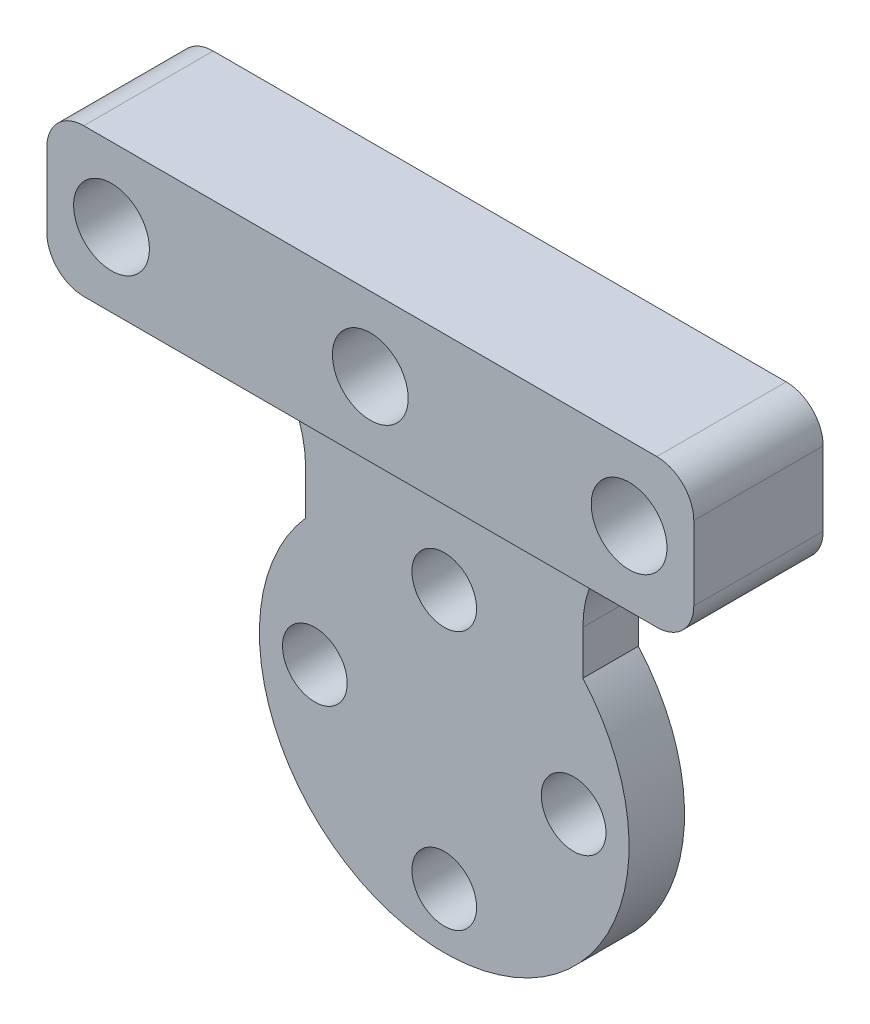
ISO-10303-21;
HEADER;
FILE_DESCRIPTION(('STEP AP214'),'2;1');
FILE_NAME('part.step','',(''),(''),'','','');
FILE_SCHEMA(('AUTOMOTIVE_DESIGN { 1 0 10303 214 1 1 1 1 }'));
ENDSEC;
DATA;
#1=APPLICATION_CONTEXT('core data for automotive mechanical design processes');
#2=APPLICATION_PROTOCOL_DEFINITION('international standard','automotive_design',2000,#1);
#3=PRODUCT_CONTEXT('',#1,'mechanical');
#4=PRODUCT('Part','Part','',(#3));
#5=PRODUCT_RELATED_PRODUCT_CATEGORY('part','',(#4));
#6=PRODUCT_DEFINITION_FORMATION('','',#4);
#7=PRODUCT_DEFINITION_CONTEXT('part definition',#1,'design');
#8=PRODUCT_DEFINITION('design','',#6,#7);
#9=PRODUCT_DEFINITION_SHAPE('','',#8);
#10=(LENGTH_UNIT() NAMED_UNIT(*) SI_UNIT(.MILLI.,.METRE.));
#11=(NAMED_UNIT(*) PLANE_ANGLE_UNIT() SI_UNIT($,.RADIAN.));
#12=(NAMED_UNIT(*) SI_UNIT($,.STERADIAN.) SOLID_ANGLE_UNIT());
#13=UNCERTAINTY_MEASURE_WITH_UNIT(LENGTH_MEASURE(1.E-05),#10,'distance_accuracy_value','');
#14=(GEOMETRIC_REPRESENTATION_CONTEXT(3) GLOBAL_UNCERTAINTY_ASSIGNED_CONTEXT((#13)) GLOBAL_UNIT_ASSIGNED_CONTEXT((#10,
#11,#12)) REPRESENTATION_CONTEXT('',''));
#15=CARTESIAN_POINT('',(0.,0.,0.));
#16=DIRECTION('',(0.,0.,1.));
#17=DIRECTION('',(1.,0.,0.));
#18=AXIS2_PLACEMENT_3D('',#15,#16,#17);
#19=CARTESIAN_POINT('',(0.,19.,0.));
#20=DIRECTION('',(0.,0.,1.));
#21=DIRECTION('',(1.,0.,0.));
#22=AXIS2_PLACEMENT_3D('',#19,#20,#21);
#23=CYLINDRICAL_SURFACE('',#22,1.75);
#24=CARTESIAN_POINT('',(0.,19.,0.));
#25=DIRECTION('',(0.,0.,1.));
#26=DIRECTION('',(1.,0.,0.));
#27=AXIS2_PLACEMENT_3D('',#24,#25,#26);
#28=CIRCLE('',#27,1.75);
#29=CARTESIAN_POINT('',(1.75,19.,0.));
#30=VERTEX_POINT('',#29);
#31=EDGE_CURVE('E274',#30,#30,#28,.T.);
#32=ORIENTED_EDGE('',*,*,#31,.F.);
#33=EDGE_LOOP('',(#32));
#34=FACE_BOUND('',#33,.T.);
#35=CARTESIAN_POINT('',(0.,19.,1.));
#36=DIRECTION('',(0.,0.,1.));
#37=DIRECTION('',(1.,0.,0.));
#38=AXIS2_PLACEMENT_3D('',#35,#36,#37);
#39=CIRCLE('',#38,1.75);
#40=CARTESIAN_POINT('',(1.75,19.,1.));
#41=VERTEX_POINT('',#40);
#42=EDGE_CURVE('E45',#41,#41,#39,.F.);
#43=ORIENTED_EDGE('',*,*,#42,.F.);
#44=EDGE_LOOP('',(#43));
#45=FACE_BOUND('',#44,.T.);
#46=ADVANCED_FACE('F41',(#34,#45),#23,.F.);
#47=CARTESIAN_POINT('',(-14.,19.,0.));
#48=DIRECTION('',(0.,0.,1.));
#49=DIRECTION('',(1.,0.,0.));
#50=AXIS2_PLACEMENT_3D('',#47,#48,#49);
#51=CYLINDRICAL_SURFACE('',#50,1.75);
#52=CARTESIAN_POINT('',(-14.,19.,0.));
#53=DIRECTION('',(0.,0.,1.));
#54=DIRECTION('',(1.,0.,0.));
#55=AXIS2_PLACEMENT_3D('',#52,#53,#54);
#56=CIRCLE('',#55,1.75);
#57=CARTESIAN_POINT('',(-12.25,19.,0.));
#58=VERTEX_POINT('',#57);
#59=EDGE_CURVE('E269',#58,#58,#56,.T.);
#60=ORIENTED_EDGE('',*,*,#59,.F.);
#61=EDGE_LOOP('',(#60));
#62=FACE_BOUND('',#61,.T.);
#63=CARTESIAN_POINT('',(-14.,19.,1.));
#64=DIRECTION('',(0.,0.,1.));
#65=DIRECTION('',(1.,0.,0.));
#66=AXIS2_PLACEMENT_3D('',#63,#64,#65);
#67=CIRCLE('',#66,1.75);
#68=CARTESIAN_POINT('',(-12.25,19.,1.));
#69=VERTEX_POINT('',#68);
#70=EDGE_CURVE('E259',#69,#69,#67,.F.);
#71=ORIENTED_EDGE('',*,*,#70,.F.);
#72=EDGE_LOOP('',(#71));
#73=FACE_BOUND('',#72,.T.);
#74=ADVANCED_FACE('F375',(#62,#73),#51,.F.);
#75=CARTESIAN_POINT('',(14.,19.,0.));
#76=DIRECTION('',(0.,0.,1.));
#77=DIRECTION('',(1.,0.,0.));
#78=AXIS2_PLACEMENT_3D('',#75,#76,#77);
#79=CYLINDRICAL_SURFACE('',#78,1.75);
#80=CARTESIAN_POINT('',(14.,19.,0.));
#81=DIRECTION('',(0.,0.,1.));
#82=DIRECTION('',(1.,0.,0.));
#83=AXIS2_PLACEMENT_3D('',#80,#81,#82);
#84=CIRCLE('',#83,1.75);
#85=CARTESIAN_POINT('',(15.75,19.,0.));
#86=VERTEX_POINT('',#85);
#87=EDGE_CURVE('E265',#86,#86,#84,.T.);
#88=ORIENTED_EDGE('',*,*,#87,.F.);
#89=EDGE_LOOP('',(#88));
#90=FACE_BOUND('',#89,.T.);
#91=CARTESIAN_POINT('',(14.,19.,1.));
#92=DIRECTION('',(0.,0.,1.));
#93=DIRECTION('',(1.,0.,0.));
#94=AXIS2_PLACEMENT_3D('',#91,#92,#93);
#95=CIRCLE('',#94,1.75);
#96=CARTESIAN_POINT('',(15.75,19.,1.));
#97=VERTEX_POINT('',#96);
#98=EDGE_CURVE('E257',#97,#97,#95,.F.);
#99=ORIENTED_EDGE('',*,*,#98,.F.);
#100=EDGE_LOOP('',(#99));
#101=FACE_BOUND('',#100,.T.);
#102=ADVANCED_FACE('F381',(#90,#101),#79,.F.);
#103=CARTESIAN_POINT('',(0.,0.,3.));
#104=DIRECTION('',(0.,0.,-1.));
#105=DIRECTION('',(-1.,0.,0.));
#106=AXIS2_PLACEMENT_3D('',#103,#104,#105);
#107=CYLINDRICAL_SURFACE('',#106,10.);
#108=DIRECTION('',(0.,0.,1.));
#109=VECTOR('',#108,1.);
#110=CARTESIAN_POINT('',(-7.5,6.61437827766148,-38.6456802143211));
#111=LINE('',#110,#109);
#112=CARTESIAN_POINT('',(-7.5,6.61437827766148,0.));
#113=VERTEX_POINT('',#112);
#114=CARTESIAN_POINT('',(-7.5,6.61437827766148,3.));
#115=VERTEX_POINT('',#114);
#116=EDGE_CURVE('E150',#113,#115,#111,.T.);
#117=ORIENTED_EDGE('',*,*,#116,.F.);
#118=CARTESIAN_POINT('',(0.,0.,0.));
#119=DIRECTION('',(0.,0.,1.));
#120=DIRECTION('',(1.,0.,0.));
#121=AXIS2_PLACEMENT_3D('',#118,#119,#120);
#122=CIRCLE('',#121,10.);
#123=CARTESIAN_POINT('',(7.5,6.61437827766148,0.));
#124=VERTEX_POINT('',#123);
#125=EDGE_CURVE('E160',#113,#124,#122,.T.);
#126=ORIENTED_EDGE('',*,*,#125,.T.);
#127=DIRECTION('',(0.,0.,1.));
#128=VECTOR('',#127,1.);
#129=CARTESIAN_POINT('',(7.5,6.61437827766148,-38.6456802143211));
#130=LINE('',#129,#128);
#131=CARTESIAN_POINT('',(7.5,6.61437827766148,3.));
#132=VERTEX_POINT('',#131);
#133=EDGE_CURVE('E173',#124,#132,#130,.T.);
#134=ORIENTED_EDGE('',*,*,#133,.T.);
#135=CARTESIAN_POINT('',(0.,0.,3.));
#136=DIRECTION('',(0.,0.,1.));
#137=DIRECTION('',(1.,0.,0.));
#138=AXIS2_PLACEMENT_3D('',#135,#136,#137);
#139=CIRCLE('',#138,10.);
#140=EDGE_CURVE('E171',#115,#132,#139,.T.);
#141=ORIENTED_EDGE('',*,*,#140,.F.);
#142=EDGE_LOOP('',(#117,#126,#134,#141));
#143=FACE_BOUND('',#142,.T.);
#144=ADVANCED_FACE('F169',(#143),#107,.T.);
#145=CARTESIAN_POINT('',(-7.,0.,3.));
#146=DIRECTION('',(0.,0.,-1.));
#147=DIRECTION('',(-1.,0.,0.));
#148=AXIS2_PLACEMENT_3D('',#145,#146,#147);
#149=CYLINDRICAL_SURFACE('',#148,1.75);
#150=CARTESIAN_POINT('',(-7.,0.,3.));
#151=DIRECTION('',(0.,0.,1.));
#152=DIRECTION('',(1.,0.,0.));
#153=AXIS2_PLACEMENT_3D('',#150,#151,#152);
#154=CIRCLE('',#153,1.75);
#155=CARTESIAN_POINT('',(-5.25,0.,3.));
#156=VERTEX_POINT('',#155);
#157=EDGE_CURVE('E192',#156,#156,#154,.T.);
#158=ORIENTED_EDGE('',*,*,#157,.T.);
#159=EDGE_LOOP('',(#158));
#160=FACE_BOUND('',#159,.T.);
#161=CARTESIAN_POINT('',(-7.,0.,0.));
#162=DIRECTION('',(0.,0.,1.));
#163=DIRECTION('',(1.,0.,0.));
#164=AXIS2_PLACEMENT_3D('',#161,#162,#163);
#165=CIRCLE('',#164,1.75);
#166=CARTESIAN_POINT('',(-5.25,0.,0.));
#167=VERTEX_POINT('',#166);
#168=EDGE_CURVE('E167',#167,#167,#165,.T.);
#169=ORIENTED_EDGE('',*,*,#168,.F.);
#170=EDGE_LOOP('',(#169));
#171=FACE_BOUND('',#170,.T.);
#172=ADVANCED_FACE('F359',(#160,#171),#149,.F.);
#173=CARTESIAN_POINT('',(0.,7.,3.));
#174=DIRECTION('',(0.,0.,-1.));
#175=DIRECTION('',(-1.,0.,0.));
#176=AXIS2_PLACEMENT_3D('',#173,#174,#175);
#177=CYLINDRICAL_SURFACE('',#176,1.75);
#178=CARTESIAN_POINT('',(0.,7.,3.));
#179=DIRECTION('',(0.,0.,1.));
#180=DIRECTION('',(1.,0.,0.));
#181=AXIS2_PLACEMENT_3D('',#178,#179,#180);
#182=CIRCLE('',#181,1.75);
#183=CARTESIAN_POINT('',(1.75,7.,3.));
#184=VERTEX_POINT('',#183);
#185=EDGE_CURVE('E189',#184,#184,#182,.T.);
#186=ORIENTED_EDGE('',*,*,#185,.T.);
#187=EDGE_LOOP('',(#186));
#188=FACE_BOUND('',#187,.T.);
#189=CARTESIAN_POINT('',(0.,7.,0.));
#190=DIRECTION('',(0.,0.,1.));
#191=DIRECTION('',(1.,0.,0.));
#192=AXIS2_PLACEMENT_3D('',#189,#190,#191);
#193=CIRCLE('',#192,1.75);
#194=CARTESIAN_POINT('',(1.75,7.,0.));
#195=VERTEX_POINT('',#194);
#196=EDGE_CURVE('E202',#195,#195,#193,.T.);
#197=ORIENTED_EDGE('',*,*,#196,.F.);
#198=EDGE_LOOP('',(#197));
#199=FACE_BOUND('',#198,.T.);
#200=ADVANCED_FACE('F362',(#188,#199),#177,.F.);
#201=CARTESIAN_POINT('',(7.,0.,3.));
#202=DIRECTION('',(0.,0.,-1.));
#203=DIRECTION('',(-1.,0.,0.));
#204=AXIS2_PLACEMENT_3D('',#201,#202,#203);
#205=CYLINDRICAL_SURFACE('',#204,1.75);
#206=CARTESIAN_POINT('',(7.,0.,3.));
#207=DIRECTION('',(0.,0.,1.));
#208=DIRECTION('',(1.,0.,0.));
#209=AXIS2_PLACEMENT_3D('',#206,#207,#208);
#210=CIRCLE('',#209,1.75);
#211=CARTESIAN_POINT('',(8.75,0.,3.));
#212=VERTEX_POINT('',#211);
#213=EDGE_CURVE('E186',#212,#212,#210,.T.);
#214=ORIENTED_EDGE('',*,*,#213,.T.);
#215=EDGE_LOOP('',(#214));
#216=FACE_BOUND('',#215,.T.);
#217=CARTESIAN_POINT('',(7.,0.,0.));
#218=DIRECTION('',(0.,0.,1.));
#219=DIRECTION('',(1.,0.,0.));
#220=AXIS2_PLACEMENT_3D('',#217,#218,#219);
#221=CIRCLE('',#220,1.75);
#222=CARTESIAN_POINT('',(8.75,0.,0.));
#223=VERTEX_POINT('',#222);
#224=EDGE_CURVE('E199',#223,#223,#221,.T.);
#225=ORIENTED_EDGE('',*,*,#224,.F.);
#226=EDGE_LOOP('',(#225));
#227=FACE_BOUND('',#226,.T.);
#228=ADVANCED_FACE('F646',(#216,#227),#205,.F.);
#229=CARTESIAN_POINT('',(0.,-7.,3.));
#230=DIRECTION('',(0.,0.,-1.));
#231=DIRECTION('',(-1.,0.,0.));
#232=AXIS2_PLACEMENT_3D('',#229,#230,#231);
#233=CYLINDRICAL_SURFACE('',#232,1.75);
#234=CARTESIAN_POINT('',(0.,-7.,3.));
#235=DIRECTION('',(0.,0.,1.));
#236=DIRECTION('',(1.,0.,0.));
#237=AXIS2_PLACEMENT_3D('',#234,#235,#236);
#238=CIRCLE('',#237,1.75);
#239=CARTESIAN_POINT('',(1.75,-7.,3.));
#240=VERTEX_POINT('',#239);
#241=EDGE_CURVE('E166',#240,#240,#238,.T.);
#242=ORIENTED_EDGE('',*,*,#241,.T.);
#243=EDGE_LOOP('',(#242));
#244=FACE_BOUND('',#243,.T.);
#245=CARTESIAN_POINT('',(0.,-7.,0.));
#246=DIRECTION('',(0.,0.,1.));
#247=DIRECTION('',(1.,0.,0.));
#248=AXIS2_PLACEMENT_3D('',#245,#246,#247);
#249=CIRCLE('',#248,1.75);
#250=CARTESIAN_POINT('',(1.75,-7.,0.));
#251=VERTEX_POINT('',#250);
#252=EDGE_CURVE('E183',#251,#251,#249,.T.);
#253=ORIENTED_EDGE('',*,*,#252,.F.);
#254=EDGE_LOOP('',(#253));
#255=FACE_BOUND('',#254,.T.);
#256=ADVANCED_FACE('F349',(#244,#255),#233,.F.);
#257=CARTESIAN_POINT('',(0.,0.,3.));
#258=DIRECTION('',(0.,0.,1.));
#259=DIRECTION('',(1.,0.,0.));
#260=AXIS2_PLACEMENT_3D('',#257,#258,#259);
#261=PLANE('',#260);
#262=DIRECTION('',(1.,0.,0.));
#263=VECTOR('',#262,1.);
#264=CARTESIAN_POINT('',(-17.5,15.,3.));
#265=LINE('',#264,#263);
#266=CARTESIAN_POINT('',(-13.5,15.,3.));
#267=VERTEX_POINT('',#266);
#268=CARTESIAN_POINT('',(13.5,15.,3.));
#269=VERTEX_POINT('',#268);
#270=EDGE_CURVE('E196',#267,#269,#265,.T.);
#271=ORIENTED_EDGE('',*,*,#270,.F.);
#272=CARTESIAN_POINT('',(-13.5,9.,3.));
#273=DIRECTION('',(0.,0.,1.));
#274=DIRECTION('',(1.,0.,0.));
#275=AXIS2_PLACEMENT_3D('',#272,#273,#274);
#276=CIRCLE('',#275,6.);
#277=CARTESIAN_POINT('',(-7.5,9.,3.));
#278=VERTEX_POINT('',#277);
#279=EDGE_CURVE('E217',#267,#278,#276,.F.);
#280=ORIENTED_EDGE('',*,*,#279,.T.);
#281=DIRECTION('',(0.,1.,0.));
#282=VECTOR('',#281,1.);
#283=CARTESIAN_POINT('',(-7.5,0.,3.));
#284=LINE('',#283,#282);
#285=EDGE_CURVE('E177',#115,#278,#284,.T.);
#286=ORIENTED_EDGE('',*,*,#285,.F.);
#287=ORIENTED_EDGE('',*,*,#140,.T.);
#288=DIRECTION('',(0.,1.,0.));
#289=VECTOR('',#288,1.);
#290=CARTESIAN_POINT('',(7.5,0.,3.));
#291=LINE('',#290,#289);
#292=CARTESIAN_POINT('',(7.5,9.,3.));
#293=VERTEX_POINT('',#292);
#294=EDGE_CURVE('E292',#132,#293,#291,.T.);
#295=ORIENTED_EDGE('',*,*,#294,.T.);
#296=CARTESIAN_POINT('',(13.5,9.,3.));
#297=DIRECTION('',(0.,0.,1.));
#298=DIRECTION('',(1.,0.,0.));
#299=AXIS2_PLACEMENT_3D('',#296,#297,#298);
#300=CIRCLE('',#299,6.);
#301=EDGE_CURVE('E221',#293,#269,#300,.F.);
#302=ORIENTED_EDGE('',*,*,#301,.T.);
#303=EDGE_LOOP('',(#271,#280,#286,#287,#295,#302));
#304=FACE_BOUND('',#303,.T.);
#305=ORIENTED_EDGE('',*,*,#241,.F.);
#306=EDGE_LOOP('',(#305));
#307=FACE_BOUND('',#306,.T.);
#308=ORIENTED_EDGE('',*,*,#213,.F.);
#309=EDGE_LOOP('',(#308));
#310=FACE_BOUND('',#309,.T.);
#311=ORIENTED_EDGE('',*,*,#185,.F.);
#312=EDGE_LOOP('',(#311));
#313=FACE_BOUND('',#312,.T.);
#314=ORIENTED_EDGE('',*,*,#157,.F.);
#315=EDGE_LOOP('',(#314));
#316=FACE_BOUND('',#315,.T.);
#317=ADVANCED_FACE('F346',(#304,#307,#310,#313,#316),#261,.T.);
#318=CARTESIAN_POINT('',(0.,0.,0.));
#319=DIRECTION('',(0.,0.,1.));
#320=DIRECTION('',(1.,0.,0.));
#321=AXIS2_PLACEMENT_3D('',#318,#319,#320);
#322=PLANE('',#321);
#323=ORIENTED_EDGE('',*,*,#87,.T.);
#324=EDGE_LOOP('',(#323));
#325=FACE_BOUND('',#324,.T.);
#326=ORIENTED_EDGE('',*,*,#59,.T.);
#327=EDGE_LOOP('',(#326));
#328=FACE_BOUND('',#327,.T.);
#329=ORIENTED_EDGE('',*,*,#31,.T.);
#330=EDGE_LOOP('',(#329));
#331=FACE_BOUND('',#330,.T.);
#332=ORIENTED_EDGE('',*,*,#252,.T.);
#333=EDGE_LOOP('',(#332));
#334=FACE_BOUND('',#333,.T.);
#335=ORIENTED_EDGE('',*,*,#224,.T.);
#336=EDGE_LOOP('',(#335));
#337=FACE_BOUND('',#336,.T.);
#338=ORIENTED_EDGE('',*,*,#196,.T.);
#339=EDGE_LOOP('',(#338));
#340=FACE_BOUND('',#339,.T.);
#341=ORIENTED_EDGE('',*,*,#168,.T.);
#342=EDGE_LOOP('',(#341));
#343=FACE_BOUND('',#342,.T.);
#344=DIRECTION('',(1.,0.,0.));
#345=VECTOR('',#344,1.);
#346=CARTESIAN_POINT('',(0.,15.,0.));
#347=LINE('',#346,#345);
#348=CARTESIAN_POINT('',(-15.5,15.,0.));
#349=VERTEX_POINT('',#348);
#350=CARTESIAN_POINT('',(-13.5,15.,0.));
#351=VERTEX_POINT('',#350);
#352=EDGE_CURVE('E157',#349,#351,#347,.T.);
#353=ORIENTED_EDGE('',*,*,#352,.F.);
#354=CARTESIAN_POINT('',(-15.5,17.,0.));
#355=DIRECTION('',(0.,0.,1.));
#356=DIRECTION('',(1.,0.,0.));
#357=AXIS2_PLACEMENT_3D('',#354,#355,#356);
#358=CIRCLE('',#357,2.);
#359=CARTESIAN_POINT('',(-17.5,17.,0.));
#360=VERTEX_POINT('',#359);
#361=EDGE_CURVE('E249',#349,#360,#358,.F.);
#362=ORIENTED_EDGE('',*,*,#361,.T.);
#363=DIRECTION('',(0.,-1.,0.));
#364=VECTOR('',#363,1.);
#365=CARTESIAN_POINT('',(-17.5,0.,0.));
#366=LINE('',#365,#364);
#367=CARTESIAN_POINT('',(-17.5,21.,0.));
#368=VERTEX_POINT('',#367);
#369=EDGE_CURVE('E298',#368,#360,#366,.T.);
#370=ORIENTED_EDGE('',*,*,#369,.F.);
#371=CARTESIAN_POINT('',(-15.5,21.,0.));
#372=DIRECTION('',(0.,0.,1.));
#373=DIRECTION('',(1.,0.,0.));
#374=AXIS2_PLACEMENT_3D('',#371,#372,#373);
#375=CIRCLE('',#374,2.);
#376=CARTESIAN_POINT('',(-15.5,23.,0.));
#377=VERTEX_POINT('',#376);
#378=EDGE_CURVE('E247',#368,#377,#375,.F.);
#379=ORIENTED_EDGE('',*,*,#378,.T.);
#380=DIRECTION('',(-1.,0.,0.));
#381=VECTOR('',#380,1.);
#382=CARTESIAN_POINT('',(0.,23.,0.));
#383=LINE('',#382,#381);
#384=CARTESIAN_POINT('',(15.5,23.,0.));
#385=VERTEX_POINT('',#384);
#386=EDGE_CURVE('E295',#385,#377,#383,.T.);
#387=ORIENTED_EDGE('',*,*,#386,.F.);
#388=CARTESIAN_POINT('',(15.5,21.,0.));
#389=DIRECTION('',(0.,0.,1.));
#390=DIRECTION('',(1.,0.,0.));
#391=AXIS2_PLACEMENT_3D('',#388,#389,#390);
#392=CIRCLE('',#391,2.);
#393=CARTESIAN_POINT('',(17.5,21.,0.));
#394=VERTEX_POINT('',#393);
#395=EDGE_CURVE('E64',#385,#394,#392,.F.);
#396=ORIENTED_EDGE('',*,*,#395,.T.);
#397=DIRECTION('',(0.,-1.,0.));
#398=VECTOR('',#397,1.);
#399=CARTESIAN_POINT('',(17.5,0.,0.));
#400=LINE('',#399,#398);
#401=CARTESIAN_POINT('',(17.5,17.,0.));
#402=VERTEX_POINT('',#401);
#403=EDGE_CURVE('E175',#394,#402,#400,.T.);
#404=ORIENTED_EDGE('',*,*,#403,.T.);
#405=CARTESIAN_POINT('',(15.5,17.,0.));
#406=DIRECTION('',(0.,0.,1.));
#407=DIRECTION('',(1.,0.,0.));
#408=AXIS2_PLACEMENT_3D('',#405,#406,#407);
#409=CIRCLE('',#408,2.);
#410=CARTESIAN_POINT('',(15.5,15.,0.));
#411=VERTEX_POINT('',#410);
#412=EDGE_CURVE('E244',#402,#411,#409,.F.);
#413=ORIENTED_EDGE('',*,*,#412,.T.);
#414=DIRECTION('',(-1.,0.,0.));
#415=VECTOR('',#414,1.);
#416=CARTESIAN_POINT('',(0.,15.,0.));
#417=LINE('',#416,#415);
#418=CARTESIAN_POINT('',(13.5,15.,0.));
#419=VERTEX_POINT('',#418);
#420=EDGE_CURVE('E172',#411,#419,#417,.T.);
#421=ORIENTED_EDGE('',*,*,#420,.T.);
#422=CARTESIAN_POINT('',(13.5,9.,0.));
#423=DIRECTION('',(0.,0.,1.));
#424=DIRECTION('',(1.,0.,0.));
#425=AXIS2_PLACEMENT_3D('',#422,#423,#424);
#426=CIRCLE('',#425,6.);
#427=CARTESIAN_POINT('',(7.5,9.,0.));
#428=VERTEX_POINT('',#427);
#429=EDGE_CURVE('E224',#419,#428,#426,.T.);
#430=ORIENTED_EDGE('',*,*,#429,.T.);
#431=DIRECTION('',(0.,-1.,0.));
#432=VECTOR('',#431,1.);
#433=CARTESIAN_POINT('',(7.5,0.,0.));
#434=LINE('',#433,#432);
#435=EDGE_CURVE('E156',#428,#124,#434,.T.);
#436=ORIENTED_EDGE('',*,*,#435,.T.);
#437=ORIENTED_EDGE('',*,*,#125,.F.);
#438=DIRECTION('',(0.,-1.,0.));
#439=VECTOR('',#438,1.);
#440=CARTESIAN_POINT('',(-7.5,0.,0.));
#441=LINE('',#440,#439);
#442=CARTESIAN_POINT('',(-7.5,9.,0.));
#443=VERTEX_POINT('',#442);
#444=EDGE_CURVE('E145',#443,#113,#441,.T.);
#445=ORIENTED_EDGE('',*,*,#444,.F.);
#446=CARTESIAN_POINT('',(-13.5,9.,0.));
#447=DIRECTION('',(0.,0.,1.));
#448=DIRECTION('',(1.,0.,0.));
#449=AXIS2_PLACEMENT_3D('',#446,#447,#448);
#450=CIRCLE('',#449,6.);
#451=EDGE_CURVE('E219',#443,#351,#450,.T.);
#452=ORIENTED_EDGE('',*,*,#451,.T.);
#453=EDGE_LOOP('',(#353,#362,#370,#379,#387,#396,#404,#413,#421,#430,#436,#437,#445,#452));
#454=FACE_BOUND('',#453,.T.);
#455=ADVANCED_FACE('F162',(#325,#328,#331,#334,#337,#340,#343,#454),#322,.F.);
#456=CARTESIAN_POINT('',(-7.5,0.,-38.6456802143211));
#457=DIRECTION('',(1.,0.,0.));
#458=DIRECTION('',(0.,0.,-1.));
#459=AXIS2_PLACEMENT_3D('',#456,#457,#458);
#460=PLANE('',#459);
#461=ORIENTED_EDGE('',*,*,#285,.T.);
#462=DIRECTION('',(0.,0.,1.));
#463=VECTOR('',#462,1.);
#464=CARTESIAN_POINT('',(-7.5,9.,0.));
#465=LINE('',#464,#463);
#466=EDGE_CURVE('E153',#278,#443,#465,.F.);
#467=ORIENTED_EDGE('',*,*,#466,.T.);
#468=ORIENTED_EDGE('',*,*,#444,.T.);
#469=ORIENTED_EDGE('',*,*,#116,.T.);
#470=EDGE_LOOP('',(#461,#467,#468,#469));
#471=FACE_BOUND('',#470,.T.);
#472=ADVANCED_FACE('F148',(#471),#460,.F.);
#473=CARTESIAN_POINT('',(0.,15.,-38.6456802143211));
#474=DIRECTION('',(0.,1.,0.));
#475=DIRECTION('',(-1.,0.,0.));
#476=AXIS2_PLACEMENT_3D('',#473,#474,#475);
#477=PLANE('',#476);
#478=DIRECTION('',(1.,0.,0.));
#479=VECTOR('',#478,1.);
#480=CARTESIAN_POINT('',(-17.5,15.,7.));
#481=LINE('',#480,#479);
#482=CARTESIAN_POINT('',(-15.5,15.,7.));
#483=VERTEX_POINT('',#482);
#484=CARTESIAN_POINT('',(15.5,15.,7.));
#485=VERTEX_POINT('',#484);
#486=EDGE_CURVE('E283',#483,#485,#481,.T.);
#487=ORIENTED_EDGE('',*,*,#486,.F.);
#488=DIRECTION('',(0.,0.,1.));
#489=VECTOR('',#488,1.);
#490=CARTESIAN_POINT('',(-15.5,15.,-38.6456802143211));
#491=LINE('',#490,#489);
#492=EDGE_CURVE('E242',#483,#349,#491,.F.);
#493=ORIENTED_EDGE('',*,*,#492,.T.);
#494=ORIENTED_EDGE('',*,*,#352,.T.);
#495=DIRECTION('',(0.,0.,1.));
#496=VECTOR('',#495,1.);
#497=CARTESIAN_POINT('',(-13.5,15.,3.));
#498=LINE('',#497,#496);
#499=EDGE_CURVE('E210',#351,#267,#498,.T.);
#500=ORIENTED_EDGE('',*,*,#499,.T.);
#501=ORIENTED_EDGE('',*,*,#270,.T.);
#502=DIRECTION('',(0.,0.,1.));
#503=VECTOR('',#502,1.);
#504=CARTESIAN_POINT('',(13.5,15.,-38.6456802143211));
#505=LINE('',#504,#503);
#506=EDGE_CURVE('E207',#269,#419,#505,.F.);
#507=ORIENTED_EDGE('',*,*,#506,.T.);
#508=ORIENTED_EDGE('',*,*,#420,.F.);
#509=DIRECTION('',(0.,0.,1.));
#510=VECTOR('',#509,1.);
#511=CARTESIAN_POINT('',(15.5,15.,7.));
#512=LINE('',#511,#510);
#513=EDGE_CURVE('E239',#411,#485,#512,.T.);
#514=ORIENTED_EDGE('',*,*,#513,.T.);
#515=EDGE_LOOP('',(#487,#493,#494,#500,#501,#507,#508,#514));
#516=FACE_BOUND('',#515,.T.);
#517=ADVANCED_FACE('F338',(#516),#477,.F.);
#518=CARTESIAN_POINT('',(-17.5,0.,-38.6456802143211));
#519=DIRECTION('',(1.,0.,0.));
#520=DIRECTION('',(0.,0.,-1.));
#521=AXIS2_PLACEMENT_3D('',#518,#519,#520);
#522=PLANE('',#521);
#523=ORIENTED_EDGE('',*,*,#369,.T.);
#524=DIRECTION('',(0.,0.,1.));
#525=VECTOR('',#524,1.);
#526=CARTESIAN_POINT('',(-17.5,17.,-38.6456802143211));
#527=LINE('',#526,#525);
#528=CARTESIAN_POINT('',(-17.5,17.,7.));
#529=VERTEX_POINT('',#528);
#530=EDGE_CURVE('E228',#360,#529,#527,.T.);
#531=ORIENTED_EDGE('',*,*,#530,.T.);
#532=DIRECTION('',(0.,-1.,0.));
#533=VECTOR('',#532,1.);
#534=CARTESIAN_POINT('',(-17.5,23.,7.));
#535=LINE('',#534,#533);
#536=CARTESIAN_POINT('',(-17.5,21.,7.));
#537=VERTEX_POINT('',#536);
#538=EDGE_CURVE('E280',#537,#529,#535,.T.);
#539=ORIENTED_EDGE('',*,*,#538,.F.);
#540=DIRECTION('',(0.,0.,1.));
#541=VECTOR('',#540,1.);
#542=CARTESIAN_POINT('',(-17.5,21.,-38.6456802143211));
#543=LINE('',#542,#541);
#544=EDGE_CURVE('E226',#537,#368,#543,.F.);
#545=ORIENTED_EDGE('',*,*,#544,.T.);
#546=EDGE_LOOP('',(#523,#531,#539,#545));
#547=FACE_BOUND('',#546,.T.);
#548=ADVANCED_FACE('F317',(#547),#522,.F.);
#549=CARTESIAN_POINT('',(0.,23.,-38.6456802143211));
#550=DIRECTION('',(0.,-1.,0.));
#551=DIRECTION('',(0.,0.,-1.));
#552=AXIS2_PLACEMENT_3D('',#549,#550,#551);
#553=PLANE('',#552);
#554=ORIENTED_EDGE('',*,*,#386,.T.);
#555=DIRECTION('',(0.,0.,1.));
#556=VECTOR('',#555,1.);
#557=CARTESIAN_POINT('',(-15.5,23.,-38.6456802143211));
#558=LINE('',#557,#556);
#559=CARTESIAN_POINT('',(-15.5,23.,7.));
#560=VERTEX_POINT('',#559);
#561=EDGE_CURVE('E253',#377,#560,#558,.T.);
#562=ORIENTED_EDGE('',*,*,#561,.T.);
#563=DIRECTION('',(-1.,0.,0.));
#564=VECTOR('',#563,1.);
#565=CARTESIAN_POINT('',(-17.5,23.,7.));
#566=LINE('',#565,#564);
#567=CARTESIAN_POINT('',(15.5,23.,7.));
#568=VERTEX_POINT('',#567);
#569=EDGE_CURVE('E289',#568,#560,#566,.T.);
#570=ORIENTED_EDGE('',*,*,#569,.F.);
#571=DIRECTION('',(0.,0.,1.));
#572=VECTOR('',#571,1.);
#573=CARTESIAN_POINT('',(15.5,23.,0.));
#574=LINE('',#573,#572);
#575=EDGE_CURVE('E251',#568,#385,#574,.F.);
#576=ORIENTED_EDGE('',*,*,#575,.T.);
#577=EDGE_LOOP('',(#554,#562,#570,#576));
#578=FACE_BOUND('',#577,.T.);
#579=ADVANCED_FACE('F328',(#578),#553,.F.);
#580=CARTESIAN_POINT('',(17.5,0.,-38.6456802143211));
#581=DIRECTION('',(1.,0.,0.));
#582=DIRECTION('',(0.,0.,-1.));
#583=AXIS2_PLACEMENT_3D('',#580,#581,#582);
#584=PLANE('',#583);
#585=ORIENTED_EDGE('',*,*,#403,.F.);
#586=DIRECTION('',(0.,0.,1.));
#587=VECTOR('',#586,1.);
#588=CARTESIAN_POINT('',(17.5,21.,7.));
#589=LINE('',#588,#587);
#590=CARTESIAN_POINT('',(17.5,21.,7.));
#591=VERTEX_POINT('',#590);
#592=EDGE_CURVE('E11',#394,#591,#589,.T.);
#593=ORIENTED_EDGE('',*,*,#592,.T.);
#594=DIRECTION('',(0.,1.,0.));
#595=VECTOR('',#594,1.);
#596=CARTESIAN_POINT('',(17.5,23.,7.));
#597=LINE('',#596,#595);
#598=CARTESIAN_POINT('',(17.5,17.,7.));
#599=VERTEX_POINT('',#598);
#600=EDGE_CURVE('E286',#599,#591,#597,.T.);
#601=ORIENTED_EDGE('',*,*,#600,.F.);
#602=DIRECTION('',(0.,0.,1.));
#603=VECTOR('',#602,1.);
#604=CARTESIAN_POINT('',(17.5,17.,0.));
#605=LINE('',#604,#603);
#606=EDGE_CURVE('E50',#599,#402,#605,.F.);
#607=ORIENTED_EDGE('',*,*,#606,.T.);
#608=EDGE_LOOP('',(#585,#593,#601,#607));
#609=FACE_BOUND('',#608,.T.);
#610=ADVANCED_FACE('F333',(#609),#584,.T.);
#611=CARTESIAN_POINT('',(7.5,0.,-38.6456802143211));
#612=DIRECTION('',(1.,0.,0.));
#613=DIRECTION('',(0.,0.,-1.));
#614=AXIS2_PLACEMENT_3D('',#611,#612,#613);
#615=PLANE('',#614);
#616=ORIENTED_EDGE('',*,*,#435,.F.);
#617=DIRECTION('',(0.,0.,1.));
#618=VECTOR('',#617,1.);
#619=CARTESIAN_POINT('',(7.5,9.,-38.6456802143211));
#620=LINE('',#619,#618);
#621=EDGE_CURVE('E214',#428,#293,#620,.T.);
#622=ORIENTED_EDGE('',*,*,#621,.T.);
#623=ORIENTED_EDGE('',*,*,#294,.F.);
#624=ORIENTED_EDGE('',*,*,#133,.F.);
#625=EDGE_LOOP('',(#616,#622,#623,#624));
#626=FACE_BOUND('',#625,.T.);
#627=ADVANCED_FACE('F344',(#626),#615,.T.);
#628=CARTESIAN_POINT('',(0.,0.,7.));
#629=DIRECTION('',(0.,0.,1.));
#630=DIRECTION('',(1.,0.,0.));
#631=AXIS2_PLACEMENT_3D('',#628,#629,#630);
#632=PLANE('',#631);
#633=CARTESIAN_POINT('',(-14.,19.,7.));
#634=DIRECTION('',(0.,0.,1.));
#635=DIRECTION('',(1.,0.,0.));
#636=AXIS2_PLACEMENT_3D('',#633,#634,#635);
#637=CIRCLE('',#636,2.05);
#638=CARTESIAN_POINT('',(-11.95,19.,7.));
#639=VERTEX_POINT('',#638);
#640=EDGE_CURVE('E719',#639,#639,#637,.T.);
#641=ORIENTED_EDGE('',*,*,#640,.F.);
#642=EDGE_LOOP('',(#641));
#643=FACE_BOUND('',#642,.T.);
#644=CARTESIAN_POINT('',(0.,19.,7.));
#645=DIRECTION('',(0.,0.,1.));
#646=DIRECTION('',(1.,0.,0.));
#647=AXIS2_PLACEMENT_3D('',#644,#645,#646);
#648=CIRCLE('',#647,2.05);
#649=CARTESIAN_POINT('',(2.05,19.,7.));
#650=VERTEX_POINT('',#649);
#651=EDGE_CURVE('E717',#650,#650,#648,.T.);
#652=ORIENTED_EDGE('',*,*,#651,.F.);
#653=EDGE_LOOP('',(#652));
#654=FACE_BOUND('',#653,.T.);
#655=CARTESIAN_POINT('',(14.,19.,7.));
#656=DIRECTION('',(0.,0.,1.));
#657=DIRECTION('',(1.,0.,0.));
#658=AXIS2_PLACEMENT_3D('',#655,#656,#657);
#659=CIRCLE('',#658,2.05);
#660=CARTESIAN_POINT('',(16.05,19.,7.));
#661=VERTEX_POINT('',#660);
#662=EDGE_CURVE('E723',#661,#661,#659,.T.);
#663=ORIENTED_EDGE('',*,*,#662,.F.);
#664=EDGE_LOOP('',(#663));
#665=FACE_BOUND('',#664,.T.);
#666=ORIENTED_EDGE('',*,*,#538,.T.);
#667=CARTESIAN_POINT('',(-15.5,17.,7.));
#668=DIRECTION('',(0.,0.,1.));
#669=DIRECTION('',(1.,0.,0.));
#670=AXIS2_PLACEMENT_3D('',#667,#668,#669);
#671=CIRCLE('',#670,2.);
#672=EDGE_CURVE('E237',#529,#483,#671,.T.);
#673=ORIENTED_EDGE('',*,*,#672,.T.);
#674=ORIENTED_EDGE('',*,*,#486,.T.);
#675=CARTESIAN_POINT('',(15.5,17.,7.));
#676=DIRECTION('',(0.,0.,1.));
#677=DIRECTION('',(1.,0.,0.));
#678=AXIS2_PLACEMENT_3D('',#675,#676,#677);
#679=CIRCLE('',#678,2.);
#680=EDGE_CURVE('E231',#485,#599,#679,.T.);
#681=ORIENTED_EDGE('',*,*,#680,.T.);
#682=ORIENTED_EDGE('',*,*,#600,.T.);
#683=CARTESIAN_POINT('',(15.5,21.,7.));
#684=DIRECTION('',(0.,0.,1.));
#685=DIRECTION('',(1.,0.,0.));
#686=AXIS2_PLACEMENT_3D('',#683,#684,#685);
#687=CIRCLE('',#686,2.);
#688=EDGE_CURVE('E233',#591,#568,#687,.T.);
#689=ORIENTED_EDGE('',*,*,#688,.T.);
#690=ORIENTED_EDGE('',*,*,#569,.T.);
#691=CARTESIAN_POINT('',(-15.5,21.,7.));
#692=DIRECTION('',(0.,0.,1.));
#693=DIRECTION('',(1.,0.,0.));
#694=AXIS2_PLACEMENT_3D('',#691,#692,#693);
#695=CIRCLE('',#694,2.);
#696=EDGE_CURVE('E235',#560,#537,#695,.T.);
#697=ORIENTED_EDGE('',*,*,#696,.T.);
#698=EDGE_LOOP('',(#666,#673,#674,#681,#682,#689,#690,#697));
#699=FACE_BOUND('',#698,.T.);
#700=ADVANCED_FACE('F320',(#643,#654,#665,#699),#632,.T.);
#701=CARTESIAN_POINT('',(-13.5,9.,-38.6456802143211));
#702=DIRECTION('',(0.,0.,-1.));
#703=DIRECTION('',(-1.,0.,0.));
#704=AXIS2_PLACEMENT_3D('',#701,#702,#703);
#705=CYLINDRICAL_SURFACE('',#704,6.);
#706=ORIENTED_EDGE('',*,*,#451,.F.);
#707=ORIENTED_EDGE('',*,*,#466,.F.);
#708=ORIENTED_EDGE('',*,*,#279,.F.);
#709=ORIENTED_EDGE('',*,*,#499,.F.);
#710=EDGE_LOOP('',(#706,#707,#708,#709));
#711=FACE_BOUND('',#710,.T.);
#712=ADVANCED_FACE('F306',(#711),#705,.F.);
#713=CARTESIAN_POINT('',(13.5,9.,-38.6456802143211));
#714=DIRECTION('',(0.,0.,1.));
#715=DIRECTION('',(1.,0.,0.));
#716=AXIS2_PLACEMENT_3D('',#713,#714,#715);
#717=CYLINDRICAL_SURFACE('',#716,6.);
#718=ORIENTED_EDGE('',*,*,#429,.F.);
#719=ORIENTED_EDGE('',*,*,#506,.F.);
#720=ORIENTED_EDGE('',*,*,#301,.F.);
#721=ORIENTED_EDGE('',*,*,#621,.F.);
#722=EDGE_LOOP('',(#718,#719,#720,#721));
#723=FACE_BOUND('',#722,.T.);
#724=ADVANCED_FACE('F345',(#723),#717,.F.);
#725=CARTESIAN_POINT('',(-15.5,17.,-38.6456802143211));
#726=DIRECTION('',(0.,0.,1.));
#727=DIRECTION('',(1.,0.,0.));
#728=AXIS2_PLACEMENT_3D('',#725,#726,#727);
#729=CYLINDRICAL_SURFACE('',#728,2.);
#730=ORIENTED_EDGE('',*,*,#361,.F.);
#731=ORIENTED_EDGE('',*,*,#492,.F.);
#732=ORIENTED_EDGE('',*,*,#672,.F.);
#733=ORIENTED_EDGE('',*,*,#530,.F.);
#734=EDGE_LOOP('',(#730,#731,#732,#733));
#735=FACE_BOUND('',#734,.T.);
#736=ADVANCED_FACE('F314',(#735),#729,.T.);
#737=CARTESIAN_POINT('',(-15.5,21.,-38.6456802143211));
#738=DIRECTION('',(0.,0.,1.));
#739=DIRECTION('',(1.,0.,0.));
#740=AXIS2_PLACEMENT_3D('',#737,#738,#739);
#741=CYLINDRICAL_SURFACE('',#740,2.);
#742=ORIENTED_EDGE('',*,*,#378,.F.);
#743=ORIENTED_EDGE('',*,*,#544,.F.);
#744=ORIENTED_EDGE('',*,*,#696,.F.);
#745=ORIENTED_EDGE('',*,*,#561,.F.);
#746=EDGE_LOOP('',(#742,#743,#744,#745));
#747=FACE_BOUND('',#746,.T.);
#748=ADVANCED_FACE('F326',(#747),#741,.T.);
#749=CARTESIAN_POINT('',(15.5,21.,-38.6456802143211));
#750=DIRECTION('',(0.,0.,-1.));
#751=DIRECTION('',(-1.,0.,0.));
#752=AXIS2_PLACEMENT_3D('',#749,#750,#751);
#753=CYLINDRICAL_SURFACE('',#752,2.);
#754=ORIENTED_EDGE('',*,*,#395,.F.);
#755=ORIENTED_EDGE('',*,*,#575,.F.);
#756=ORIENTED_EDGE('',*,*,#688,.F.);
#757=ORIENTED_EDGE('',*,*,#592,.F.);
#758=EDGE_LOOP('',(#754,#755,#756,#757));
#759=FACE_BOUND('',#758,.T.);
#760=ADVANCED_FACE('F332',(#759),#753,.T.);
#761=CARTESIAN_POINT('',(15.5,17.,-38.6456802143211));
#762=DIRECTION('',(0.,0.,-1.));
#763=DIRECTION('',(-1.,0.,0.));
#764=AXIS2_PLACEMENT_3D('',#761,#762,#763);
#765=CYLINDRICAL_SURFACE('',#764,2.);
#766=ORIENTED_EDGE('',*,*,#412,.F.);
#767=ORIENTED_EDGE('',*,*,#606,.F.);
#768=ORIENTED_EDGE('',*,*,#680,.F.);
#769=ORIENTED_EDGE('',*,*,#513,.F.);
#770=EDGE_LOOP('',(#766,#767,#768,#769));
#771=FACE_BOUND('',#770,.T.);
#772=ADVANCED_FACE('F43',(#771),#765,.T.);
#773=CARTESIAN_POINT('',(14.,19.,1.));
#774=DIRECTION('',(0.,0.,1.));
#775=DIRECTION('',(1.,0.,0.));
#776=AXIS2_PLACEMENT_3D('',#773,#774,#775);
#777=PLANE('',#776);
#778=CARTESIAN_POINT('',(14.,19.,1.));
#779=DIRECTION('',(0.,0.,1.));
#780=DIRECTION('',(1.,0.,0.));
#781=AXIS2_PLACEMENT_3D('',#778,#779,#780);
#782=CIRCLE('',#781,2.05);
#783=CARTESIAN_POINT('',(16.05,19.,1.));
#784=VERTEX_POINT('',#783);
#785=EDGE_CURVE('E728',#784,#784,#782,.T.);
#786=ORIENTED_EDGE('',*,*,#785,.T.);
#787=EDGE_LOOP('',(#786));
#788=FACE_BOUND('',#787,.T.);
#789=ORIENTED_EDGE('',*,*,#98,.T.);
#790=EDGE_LOOP('',(#789));
#791=FACE_BOUND('',#790,.T.);
#792=ADVANCED_FACE('F446',(#788,#791),#777,.T.);
#793=CARTESIAN_POINT('',(14.,19.,1.));
#794=DIRECTION('',(0.,0.,1.));
#795=DIRECTION('',(1.,0.,0.));
#796=AXIS2_PLACEMENT_3D('',#793,#794,#795);
#797=CYLINDRICAL_SURFACE('',#796,2.05);
#798=ORIENTED_EDGE('',*,*,#785,.F.);
#799=EDGE_LOOP('',(#798));
#800=FACE_BOUND('',#799,.T.);
#801=ORIENTED_EDGE('',*,*,#662,.T.);
#802=EDGE_LOOP('',(#801));
#803=FACE_BOUND('',#802,.T.);
#804=ADVANCED_FACE('F451',(#800,#803),#797,.F.);
#805=CARTESIAN_POINT('',(-14.,19.,1.));
#806=DIRECTION('',(0.,0.,1.));
#807=DIRECTION('',(1.,0.,0.));
#808=AXIS2_PLACEMENT_3D('',#805,#806,#807);
#809=PLANE('',#808);
#810=CARTESIAN_POINT('',(-14.,19.,1.));
#811=DIRECTION('',(0.,0.,1.));
#812=DIRECTION('',(1.,0.,0.));
#813=AXIS2_PLACEMENT_3D('',#810,#811,#812);
#814=CIRCLE('',#813,2.05);
#815=CARTESIAN_POINT('',(-11.95,19.,1.));
#816=VERTEX_POINT('',#815);
#817=EDGE_CURVE('E260',#816,#816,#814,.T.);
#818=ORIENTED_EDGE('',*,*,#817,.T.);
#819=EDGE_LOOP('',(#818));
#820=FACE_BOUND('',#819,.T.);
#821=ORIENTED_EDGE('',*,*,#70,.T.);
#822=EDGE_LOOP('',(#821));
#823=FACE_BOUND('',#822,.T.);
#824=ADVANCED_FACE('F459',(#820,#823),#809,.T.);
#825=CARTESIAN_POINT('',(-14.,19.,1.));
#826=DIRECTION('',(0.,0.,1.));
#827=DIRECTION('',(1.,0.,0.));
#828=AXIS2_PLACEMENT_3D('',#825,#826,#827);
#829=CYLINDRICAL_SURFACE('',#828,2.05);
#830=ORIENTED_EDGE('',*,*,#817,.F.);
#831=EDGE_LOOP('',(#830));
#832=FACE_BOUND('',#831,.T.);
#833=ORIENTED_EDGE('',*,*,#640,.T.);
#834=EDGE_LOOP('',(#833));
#835=FACE_BOUND('',#834,.T.);
#836=ADVANCED_FACE('F467',(#832,#835),#829,.F.);
#837=CARTESIAN_POINT('',(0.,19.,1.));
#838=DIRECTION('',(0.,0.,1.));
#839=DIRECTION('',(1.,0.,0.));
#840=AXIS2_PLACEMENT_3D('',#837,#838,#839);
#841=PLANE('',#840);
#842=CARTESIAN_POINT('',(0.,19.,1.));
#843=DIRECTION('',(0.,0.,1.));
#844=DIRECTION('',(1.,0.,0.));
#845=AXIS2_PLACEMENT_3D('',#842,#843,#844);
#846=CIRCLE('',#845,2.05);
#847=CARTESIAN_POINT('',(2.05,19.,1.));
#848=VERTEX_POINT('',#847);
#849=EDGE_CURVE('E714',#848,#848,#846,.T.);
#850=ORIENTED_EDGE('',*,*,#849,.T.);
#851=EDGE_LOOP('',(#850));
#852=FACE_BOUND('',#851,.T.);
#853=ORIENTED_EDGE('',*,*,#42,.T.);
#854=EDGE_LOOP('',(#853));
#855=FACE_BOUND('',#854,.T.);
#856=ADVANCED_FACE('F475',(#852,#855),#841,.T.);
#857=CARTESIAN_POINT('',(0.,19.,1.));
#858=DIRECTION('',(0.,0.,1.));
#859=DIRECTION('',(1.,0.,0.));
#860=AXIS2_PLACEMENT_3D('',#857,#858,#859);
#861=CYLINDRICAL_SURFACE('',#860,2.05);
#862=ORIENTED_EDGE('',*,*,#849,.F.);
#863=EDGE_LOOP('',(#862));
#864=FACE_BOUND('',#863,.T.);
#865=ORIENTED_EDGE('',*,*,#651,.T.);
#866=EDGE_LOOP('',(#865));
#867=FACE_BOUND('',#866,.T.);
#868=ADVANCED_FACE('F483',(#864,#867),#861,.F.);
#869=CLOSED_SHELL('',(#46,#74,#102,#144,#172,#200,#228,#256,#317,#455,#472,#517,#548,#579,#610,
#627,#700,#712,#724,#736,#748,#760,#772,#792,#804,#824,#836,#856,#868));
#870=MANIFOLD_SOLID_BREP('B2',#869);
#871=ADVANCED_BREP_SHAPE_REPRESENTATION('',(#18,#870),#14);
#872=SHAPE_DEFINITION_REPRESENTATION(#9,#871);
ENDSEC;
END-ISO-10303-21;
